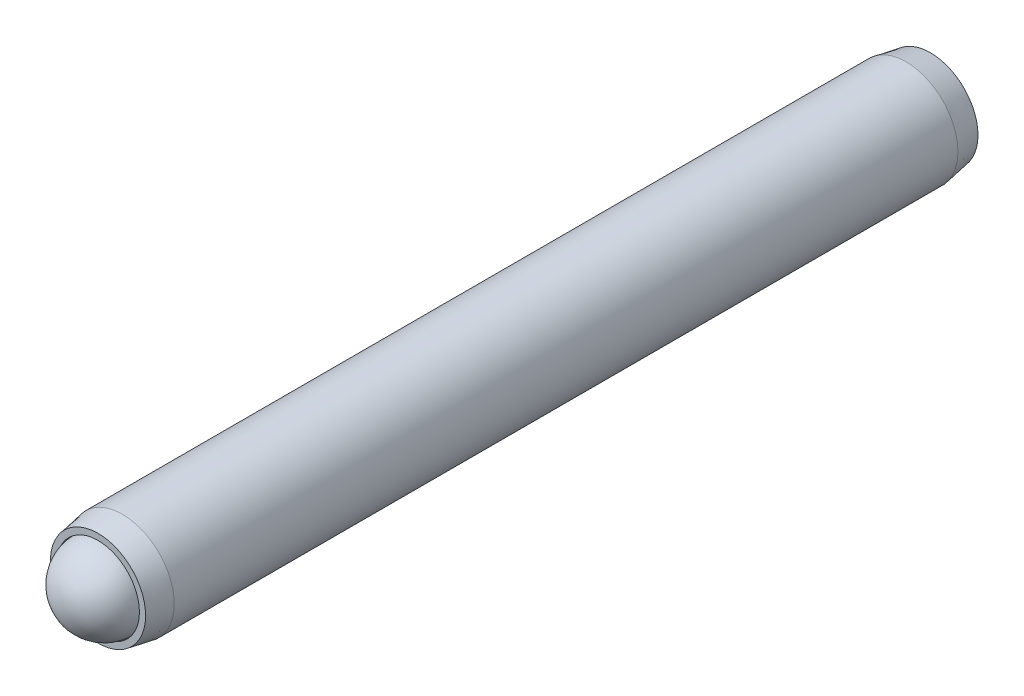
ISO-10303-21;
HEADER;
FILE_DESCRIPTION(('STEP AP214'),'2;1');
FILE_NAME('part.step','',(''),(''),'','','');
FILE_SCHEMA(('AUTOMOTIVE_DESIGN { 1 0 10303 214 1 1 1 1 }'));
ENDSEC;
DATA;
#1=APPLICATION_CONTEXT('core data for automotive mechanical design processes');
#2=APPLICATION_PROTOCOL_DEFINITION('international standard','automotive_design',2000,#1);
#3=PRODUCT_CONTEXT('',#1,'mechanical');
#4=PRODUCT('Part','Part','',(#3));
#5=PRODUCT_RELATED_PRODUCT_CATEGORY('part','',(#4));
#6=PRODUCT_DEFINITION_FORMATION('','',#4);
#7=PRODUCT_DEFINITION_CONTEXT('part definition',#1,'design');
#8=PRODUCT_DEFINITION('design','',#6,#7);
#9=PRODUCT_DEFINITION_SHAPE('','',#8);
#10=(LENGTH_UNIT() NAMED_UNIT(*) SI_UNIT(.MILLI.,.METRE.));
#11=(NAMED_UNIT(*) PLANE_ANGLE_UNIT() SI_UNIT($,.RADIAN.));
#12=(NAMED_UNIT(*) SI_UNIT($,.STERADIAN.) SOLID_ANGLE_UNIT());
#13=UNCERTAINTY_MEASURE_WITH_UNIT(LENGTH_MEASURE(1.E-05),#10,'distance_accuracy_value','');
#14=(GEOMETRIC_REPRESENTATION_CONTEXT(3) GLOBAL_UNCERTAINTY_ASSIGNED_CONTEXT((#13)) GLOBAL_UNIT_ASSIGNED_CONTEXT((#10,
#11,#12)) REPRESENTATION_CONTEXT('',''));
#15=CARTESIAN_POINT('',(0.,0.,0.));
#16=DIRECTION('',(0.,0.,1.));
#17=DIRECTION('',(1.,0.,0.));
#18=AXIS2_PLACEMENT_3D('',#15,#16,#17);
#19=CARTESIAN_POINT('',(0.,0.,24.000000038));
#20=DIRECTION('',(0.,0.,-1.));
#21=DIRECTION('',(-1.,0.,0.));
#22=AXIS2_PLACEMENT_3D('',#19,#20,#21);
#23=CYLINDRICAL_SURFACE('',#22,2.991);
#24=CARTESIAN_POINT('',(0.,0.,22.5946564030987));
#25=DIRECTION('',(0.,0.,1.));
#26=DIRECTION('',(1.,0.,0.));
#27=AXIS2_PLACEMENT_3D('',#24,#25,#26);
#28=CIRCLE('',#27,2.991);
#29=CARTESIAN_POINT('',(2.991,0.,22.5946564030987));
#30=VERTEX_POINT('',#29);
#31=EDGE_CURVE('P0_E184',#30,#30,#28,.T.);
#32=ORIENTED_EDGE('',*,*,#31,.F.);
#33=EDGE_LOOP('',(#32));
#34=FACE_BOUND('',#33,.T.);
#35=CARTESIAN_POINT('',(0.,0.,-22.5946564030986));
#36=DIRECTION('',(0.,0.,1.));
#37=DIRECTION('',(1.,0.,0.));
#38=AXIS2_PLACEMENT_3D('',#35,#36,#37);
#39=CIRCLE('',#38,2.99100000000001);
#40=CARTESIAN_POINT('',(2.99100000000001,0.,-22.5946564030986));
#41=VERTEX_POINT('',#40);
#42=EDGE_CURVE('P0_E187',#41,#41,#39,.T.);
#43=ORIENTED_EDGE('',*,*,#42,.T.);
#44=EDGE_LOOP('',(#43));
#45=FACE_BOUND('',#44,.T.);
#46=ADVANCED_FACE('P0_F16',(#34,#45),#23,.T.);
#47=CARTESIAN_POINT('',(0.,0.,24.000000038));
#48=DIRECTION('',(0.,0.,-1.));
#49=DIRECTION('',(-1.,0.,0.));
#50=AXIS2_PLACEMENT_3D('',#47,#48,#49);
#51=CONICAL_SURFACE('',#50,2.7432,0.174532925199426);
#52=ORIENTED_EDGE('',*,*,#31,.T.);
#53=EDGE_LOOP('',(#52));
#54=FACE_BOUND('',#53,.T.);
#55=CARTESIAN_POINT('',(0.,0.,24.000000038));
#56=DIRECTION('',(0.,0.,1.));
#57=DIRECTION('',(1.,0.,0.));
#58=AXIS2_PLACEMENT_3D('',#55,#56,#57);
#59=CIRCLE('',#58,2.7432);
#60=CARTESIAN_POINT('',(2.7432,0.,24.000000038));
#61=VERTEX_POINT('',#60);
#62=EDGE_CURVE('P0_E200',#61,#61,#59,.T.);
#63=ORIENTED_EDGE('',*,*,#62,.F.);
#64=EDGE_LOOP('',(#63));
#65=FACE_BOUND('',#64,.T.);
#66=ADVANCED_FACE('P0_F162',(#54,#65),#51,.T.);
#67=CARTESIAN_POINT('',(0.,0.,24.000000038));
#68=DIRECTION('',(0.,0.,1.));
#69=DIRECTION('',(1.,0.,0.));
#70=AXIS2_PLACEMENT_3D('',#67,#68,#69);
#71=PLANE('',#70);
#72=CARTESIAN_POINT('',(0.,0.,24.000000038));
#73=DIRECTION('',(0.,0.,1.));
#74=DIRECTION('',(1.,0.,0.));
#75=AXIS2_PLACEMENT_3D('',#72,#73,#74);
#76=CIRCLE('',#75,2.3876);
#77=CARTESIAN_POINT('',(2.3876,0.,24.000000038));
#78=VERTEX_POINT('',#77);
#79=EDGE_CURVE('P0_E195',#78,#78,#76,.T.);
#80=ORIENTED_EDGE('',*,*,#79,.F.);
#81=EDGE_LOOP('',(#80));
#82=FACE_BOUND('',#81,.T.);
#83=ORIENTED_EDGE('',*,*,#62,.T.);
#84=EDGE_LOOP('',(#83));
#85=FACE_BOUND('',#84,.T.);
#86=ADVANCED_FACE('P0_F159',(#82,#85),#71,.T.);
#87=CARTESIAN_POINT('',(0.,0.,-22.5946564030986));
#88=DIRECTION('',(0.,0.,1.));
#89=DIRECTION('',(1.,0.,0.));
#90=AXIS2_PLACEMENT_3D('',#87,#88,#89);
#91=CONICAL_SURFACE('',#90,2.99100000000001,0.174532925199426);
#92=CARTESIAN_POINT('',(0.,0.,-24.000000038));
#93=DIRECTION('',(0.,0.,1.));
#94=DIRECTION('',(1.,0.,0.));
#95=AXIS2_PLACEMENT_3D('',#92,#93,#94);
#96=CIRCLE('',#95,2.7432);
#97=CARTESIAN_POINT('',(2.7432,0.,-24.000000038));
#98=VERTEX_POINT('',#97);
#99=EDGE_CURVE('P0_E189',#98,#98,#96,.T.);
#100=ORIENTED_EDGE('',*,*,#99,.T.);
#101=EDGE_LOOP('',(#100));
#102=FACE_BOUND('',#101,.T.);
#103=ORIENTED_EDGE('',*,*,#42,.F.);
#104=EDGE_LOOP('',(#103));
#105=FACE_BOUND('',#104,.T.);
#106=ADVANCED_FACE('P0_F161',(#102,#105),#91,.T.);
#107=CARTESIAN_POINT('',(0.,0.,-24.000000038));
#108=DIRECTION('',(0.,0.,1.));
#109=DIRECTION('',(1.,0.,0.));
#110=AXIS2_PLACEMENT_3D('',#107,#108,#109);
#111=PLANE('',#110);
#112=CARTESIAN_POINT('',(0.,0.,-24.000000038));
#113=DIRECTION('',(0.,0.,1.));
#114=DIRECTION('',(1.,0.,0.));
#115=AXIS2_PLACEMENT_3D('',#112,#113,#114);
#116=CIRCLE('',#115,1.14567944042316);
#117=CARTESIAN_POINT('',(0.572839720211583,-0.992187499999999,-24.000000038));
#118=VERTEX_POINT('',#117);
#119=CARTESIAN_POINT('',(1.14567944042316,0.,-24.000000038));
#120=VERTEX_POINT('',#119);
#121=EDGE_CURVE('P0_E19',#118,#120,#116,.T.);
#122=ORIENTED_EDGE('',*,*,#121,.T.);
#123=CARTESIAN_POINT('',(0.572839720211582,0.9921875,-24.000000038));
#124=VERTEX_POINT('',#123);
#125=EDGE_CURVE('P0_E11',#120,#124,#116,.T.);
#126=ORIENTED_EDGE('',*,*,#125,.T.);
#127=CARTESIAN_POINT('',(-0.572839720211582,0.9921875,-24.000000038));
#128=VERTEX_POINT('',#127);
#129=EDGE_CURVE('P0_E24',#124,#128,#116,.T.);
#130=ORIENTED_EDGE('',*,*,#129,.T.);
#131=CARTESIAN_POINT('',(0.,0.,-24.000000038));
#132=DIRECTION('',(0.,0.,-1.));
#133=DIRECTION('',(-1.,0.,0.));
#134=AXIS2_PLACEMENT_3D('',#131,#132,#133);
#135=CIRCLE('',#134,1.14567944042316);
#136=CARTESIAN_POINT('',(-1.14567944042316,0.,-24.000000038));
#137=VERTEX_POINT('',#136);
#138=EDGE_CURVE('P0_E77',#137,#128,#135,.T.);
#139=ORIENTED_EDGE('',*,*,#138,.F.);
#140=CARTESIAN_POINT('',(-0.572839720211581,-0.9921875,-24.000000038));
#141=VERTEX_POINT('',#140);
#142=EDGE_CURVE('P0_E85',#137,#141,#116,.T.);
#143=ORIENTED_EDGE('',*,*,#142,.T.);
#144=EDGE_CURVE('P0_E90',#141,#118,#116,.T.);
#145=ORIENTED_EDGE('',*,*,#144,.T.);
#146=EDGE_LOOP('',(#122,#126,#130,#139,#143,#145));
#147=FACE_BOUND('',#146,.T.);
#148=ORIENTED_EDGE('',*,*,#99,.F.);
#149=EDGE_LOOP('',(#148));
#150=FACE_BOUND('',#149,.T.);
#151=ADVANCED_FACE('P0_F91',(#147,#150),#111,.F.);
#152=CARTESIAN_POINT('',(0.,0.,22.6644039925991));
#153=DIRECTION('',(0.,0.,1.));
#154=DIRECTION('',(1.,0.,0.));
#155=AXIS2_PLACEMENT_3D('',#152,#153,#154);
#156=CONICAL_SURFACE('',#155,2.3876,0.78539816339745);
#157=CARTESIAN_POINT('',(0.,0.,20.2768039925991));
#158=VERTEX_POINT('',#157);
#159=VERTEX_LOOP('',#158);
#160=FACE_BOUND('',#159,.T.);
#161=CARTESIAN_POINT('',(0.,0.,22.6644039925991));
#162=DIRECTION('',(0.,0.,1.));
#163=DIRECTION('',(1.,0.,0.));
#164=AXIS2_PLACEMENT_3D('',#161,#162,#163);
#165=CIRCLE('',#164,2.3876);
#166=CARTESIAN_POINT('',(2.3876,0.,22.6644039925991));
#167=VERTEX_POINT('',#166);
#168=EDGE_CURVE('P0_E190',#167,#167,#165,.T.);
#169=ORIENTED_EDGE('',*,*,#168,.T.);
#170=EDGE_LOOP('',(#169));
#171=FACE_BOUND('',#170,.T.);
#172=ADVANCED_FACE('P0_F165',(#160,#171),#156,.F.);
#173=CARTESIAN_POINT('',(0.,0.,24.000000038));
#174=DIRECTION('',(0.,0.,1.));
#175=DIRECTION('',(1.,0.,0.));
#176=AXIS2_PLACEMENT_3D('',#173,#174,#175);
#177=CYLINDRICAL_SURFACE('',#176,2.3876);
#178=ORIENTED_EDGE('',*,*,#168,.F.);
#179=EDGE_LOOP('',(#178));
#180=FACE_BOUND('',#179,.T.);
#181=ORIENTED_EDGE('',*,*,#79,.T.);
#182=EDGE_LOOP('',(#181));
#183=FACE_BOUND('',#182,.T.);
#184=ADVANCED_FACE('P0_F132',(#180,#183),#177,.F.);
#185=CARTESIAN_POINT('',(0.,0.,-24.000000038));
#186=DIRECTION('',(0.,0.,-1.));
#187=DIRECTION('',(-1.,0.,0.));
#188=AXIS2_PLACEMENT_3D('',#185,#186,#187);
#189=CONICAL_SURFACE('',#188,1.14567944042316,0.78539816339745);
#190=ORIENTED_EDGE('',*,*,#121,.F.);
#191=CARTESIAN_POINT('',(1.145794910477,0.000200000000000163,-24.000115525509));
#192=CARTESIAN_POINT('',(1.12609913995856,-0.0339140752321556,-23.9804328494047));
#193=CARTESIAN_POINT('',(1.10607402631377,-0.068598589492279,-23.9619057225184));
#194=CARTESIAN_POINT('',(1.06524035596264,-0.139324581199959,-23.9279823676504));
#195=CARTESIAN_POINT('',(1.04442791197037,-0.175372791624242,-23.9126050252309));
#196=CARTESIAN_POINT('',(1.00246048249572,-0.248062511737396,-23.8862631807343));
#197=CARTESIAN_POINT('',(0.981316196707011,-0.284685489013202,-23.8752324345131));
#198=CARTESIAN_POINT('',(0.938562244623587,-0.358737506246057,-23.8582362436729));
#199=CARTESIAN_POINT('',(0.916953885244212,-0.396164282559343,-23.8522581055789));
#200=CARTESIAN_POINT('',(0.879714587318153,-0.460664638605471,-23.8468663829143));
#201=CARTESIAN_POINT('',(0.864132099442441,-0.48765429931453,-23.8460690343883));
#202=CARTESIAN_POINT('',(0.832997298779852,-0.541581355945664,-23.8474082313614));
#203=CARTESIAN_POINT('',(0.817444993408172,-0.56851873902424,-23.849545424137));
#204=CARTESIAN_POINT('',(0.771010163908484,-0.648946222958497,-23.860217609306));
#205=CARTESIAN_POINT('',(0.740358726795445,-0.702036069363283,-23.8730144187227));
#206=CARTESIAN_POINT('',(0.686562055130079,-0.795214637965797,-23.9038975056501));
#207=CARTESIAN_POINT('',(0.663164549602744,-0.835740306309517,-23.9203650469077));
#208=CARTESIAN_POINT('',(0.617285982385522,-0.915204315708207,-23.9574604215568));
#209=CARTESIAN_POINT('',(0.594802217831307,-0.954147338261524,-23.9780747186455));
#210=CARTESIAN_POINT('',(0.572724250157744,-0.992387499999999,-24.000115525509));
#211=B_SPLINE_CURVE_WITH_KNOTS('',3,(#191,#192,#193,#194,#195,#196,#197,#198,#199,#200,#201,
#202,#203,#204,#205,#206,#207,#208,#209,#210),.UNSPECIFIED.,.F.,.F.,(4,2,2,2,2,2,2,2,2,4),(0.,
0.132197185210189,0.265165186853264,0.396020097605671,0.526545281028576,0.619935205043266,
0.713345731536166,0.90022005184637,1.04884529769095,1.1969930355767),.UNSPECIFIED.);
#212=EDGE_CURVE('P0_E109',#120,#118,#211,.T.);
#213=ORIENTED_EDGE('',*,*,#212,.F.);
#214=EDGE_LOOP('',(#190,#213));
#215=FACE_BOUND('',#214,.T.);
#216=ADVANCED_FACE('P0_F127',(#215),#189,.F.);
#217=ORIENTED_EDGE('',*,*,#144,.F.);
#218=CARTESIAN_POINT('',(-1.14247621095534,-0.9921875,-24.3674920775338));
#219=CARTESIAN_POINT('',(-1.11465764817298,-0.9921875,-24.3464916773704));
#220=CARTESIAN_POINT('',(-1.0866840810974,-0.9921875,-24.3256971858216));
#221=CARTESIAN_POINT('',(-1.03036405380653,-0.9921875,-24.2846050757931));
#222=CARTESIAN_POINT('',(-1.00201750238008,-0.9921875,-24.2643075824585));
#223=CARTESIAN_POINT('',(-0.915909012474787,-0.9921875,-24.2039985455809));
#224=CARTESIAN_POINT('',(-0.857501195957521,-0.9921875,-24.16489389025));
#225=CARTESIAN_POINT('',(-0.735022281337407,-0.9921875,-24.0881267908187));
#226=CARTESIAN_POINT('',(-0.670818221979874,-0.9921875,-24.0506740690437));
#227=CARTESIAN_POINT('',(-0.539203244273797,-0.9921875,-23.9821650584898));
#228=CARTESIAN_POINT('',(-0.471804119013398,-0.9921875,-23.9510872062744));
#229=CARTESIAN_POINT('',(-0.370637445291611,-0.9921875,-23.91306633425));
#230=CARTESIAN_POINT('',(-0.338367677294403,-0.9921875,-23.9021540703464));
#231=CARTESIAN_POINT('',(-0.273049086298103,-0.9921875,-23.882920268113));
#232=CARTESIAN_POINT('',(-0.24000020979791,-0.9921875,-23.8745989082603));
#233=CARTESIAN_POINT('',(-0.173878395879218,-0.9921875,-23.8611188116932));
#234=CARTESIAN_POINT('',(-0.140816774783573,-0.9921875,-23.8559054319747));
#235=CARTESIAN_POINT('',(-0.0743291672741449,-0.9921875,-23.8487397504628));
#236=CARTESIAN_POINT('',(-0.0409031260707369,-0.9921875,-23.8467879460388));
#237=CARTESIAN_POINT('',(0.0247631140270456,-0.9921875,-23.8462935239037));
#238=CARTESIAN_POINT('',(0.0570024444112259,-0.9921875,-23.8476300694157));
#239=CARTESIAN_POINT('',(0.121194220405733,-0.9921875,-23.8533710812024));
#240=CARTESIAN_POINT('',(0.15314673026799,-0.9921875,-23.8577748420789));
#241=CARTESIAN_POINT('',(0.21709052455367,-0.9921875,-23.8694845491375));
#242=CARTESIAN_POINT('',(0.249072542042749,-0.9921875,-23.8768403404107));
#243=CARTESIAN_POINT('',(0.312337779646056,-0.9921875,-23.8940631293517));
#244=CARTESIAN_POINT('',(0.34362105799319,-0.9921875,-23.9039299168974));
#245=CARTESIAN_POINT('',(0.442112982998623,-0.9921875,-23.9387061495409));
#246=CARTESIAN_POINT('',(0.507919771037746,-0.9921875,-23.967576202078));
#247=CARTESIAN_POINT('',(0.636441890981752,-0.9921875,-24.0317652478148));
#248=CARTESIAN_POINT('',(0.699145053739847,-0.9921875,-24.0671074100824));
#249=CARTESIAN_POINT('',(0.818979829838888,-0.9921875,-24.1400214087045));
#250=CARTESIAN_POINT('',(0.876233471440133,-0.9921875,-24.1773951728683));
#251=CARTESIAN_POINT('',(0.960585190489406,-0.9921875,-24.235171149699));
#252=CARTESIAN_POINT('',(0.988338378120956,-0.9921875,-24.254633525457));
#253=CARTESIAN_POINT('',(1.0434655130954,-0.9921875,-24.294073019541));
#254=CARTESIAN_POINT('',(1.070839562073,-0.9921875,-24.3140499956456));
#255=CARTESIAN_POINT('',(1.09805574489948,-0.9921875,-24.3342403433952));
#256=B_SPLINE_CURVE_WITH_KNOTS('',3,(#218,#219,#220,#221,#222,#223,#224,#225,#226,#227,#228,
#229,#230,#231,#232,#233,#234,#235,#236,#237,#238,#239,#240,#241,#242,#243,#244,#245,#246,#247,
#248,#249,#250,#251,#252,#253,#254,#255),.UNSPECIFIED.,.F.,.F.,(4,2,2,2,2,2,2,2,2,2,2,2,2,2,2,2,
2,2,4),(0.,0.104563127391605,0.209152318718919,0.419927099055486,0.642732653996016,
0.864771652302191,0.966879847198762,1.06899507437088,1.1692575299655,1.2695352735478,
1.36618351698525,1.46280954060141,1.56114078104352,1.65946379575192,1.87441437169281,
2.09015003601501,2.29516517561957,2.39685303361286,2.49851308319261),.UNSPECIFIED.);
#257=EDGE_CURVE('P0_E107',#118,#141,#256,.F.);
#258=ORIENTED_EDGE('',*,*,#257,.F.);
#259=EDGE_LOOP('',(#217,#258));
#260=FACE_BOUND('',#259,.T.);
#261=ADVANCED_FACE('P0_F131',(#260),#189,.F.);
#262=ORIENTED_EDGE('',*,*,#142,.F.);
#263=CARTESIAN_POINT('',(-0.572724250157744,-0.9923875,-24.000115525509));
#264=CARTESIAN_POINT('',(-0.592420020676185,-0.958273424767843,-23.9804328494047));
#265=CARTESIAN_POINT('',(-0.612445134320979,-0.923588910507719,-23.9619057225184));
#266=CARTESIAN_POINT('',(-0.653278804672111,-0.85286291880004,-23.9279823676504));
#267=CARTESIAN_POINT('',(-0.674091248664375,-0.816814708375757,-23.9126050252309));
#268=CARTESIAN_POINT('',(-0.716058678139022,-0.744124988262603,-23.8862631807343));
#269=CARTESIAN_POINT('',(-0.737202963927734,-0.707502010986797,-23.8752324345131));
#270=CARTESIAN_POINT('',(-0.779956916011158,-0.633449993753942,-23.8582362436729));
#271=CARTESIAN_POINT('',(-0.801565275390534,-0.596023217440656,-23.8522581055789));
#272=CARTESIAN_POINT('',(-0.838804573316593,-0.531522861394528,-23.8468663829143));
#273=CARTESIAN_POINT('',(-0.854387061192304,-0.504533200685469,-23.8460690343883));
#274=CARTESIAN_POINT('',(-0.885521861854894,-0.450606144054335,-23.8474082313614));
#275=CARTESIAN_POINT('',(-0.901074167226574,-0.423668760975759,-23.849545424137));
#276=CARTESIAN_POINT('',(-0.947508996726262,-0.343241277041502,-23.860217609306));
#277=CARTESIAN_POINT('',(-0.9781604338393,-0.290151430636716,-23.8730144187227));
#278=CARTESIAN_POINT('',(-1.03195710550467,-0.196972862034201,-23.9038975056501));
#279=CARTESIAN_POINT('',(-1.055354611032,-0.156447193690482,-23.9203650469077));
#280=CARTESIAN_POINT('',(-1.10123317824922,-0.0769831842917917,-23.9574604215568));
#281=CARTESIAN_POINT('',(-1.12371694280344,-0.0380401617384757,-23.9780747186455));
#282=CARTESIAN_POINT('',(-1.145794910477,0.000200000000000038,-24.000115525509));
#283=B_SPLINE_CURVE_WITH_KNOTS('',3,(#263,#264,#265,#266,#267,#268,#269,#270,#271,#272,#273,
#274,#275,#276,#277,#278,#279,#280,#281,#282),.UNSPECIFIED.,.F.,.F.,(4,2,2,2,2,2,2,2,2,4),(0.,
0.132197185210191,0.265165186853264,0.396020097605672,0.526545281028576,0.619935205043266,
0.713345731536166,0.900220051846371,1.04884529769095,1.1969930355767),.UNSPECIFIED.);
#284=EDGE_CURVE('P0_E80',#141,#137,#283,.T.);
#285=ORIENTED_EDGE('',*,*,#284,.F.);
#286=EDGE_LOOP('',(#262,#285));
#287=FACE_BOUND('',#286,.T.);
#288=ADVANCED_FACE('P0_F86',(#287),#189,.F.);
#289=ORIENTED_EDGE('',*,*,#138,.T.);
#290=CARTESIAN_POINT('',(-1.145794910477,-0.000200000000000018,-24.000115525509));
#291=CARTESIAN_POINT('',(-1.12609913995856,0.0339140752321562,-23.9804328494047));
#292=CARTESIAN_POINT('',(-1.10607402631377,0.06859858949228,-23.9619057225184));
#293=CARTESIAN_POINT('',(-1.06524035596264,0.139324581199959,-23.9279823676504));
#294=CARTESIAN_POINT('',(-1.04442791197037,0.175372791624242,-23.9126050252309));
#295=CARTESIAN_POINT('',(-1.00246048249572,0.248062511737396,-23.8862631807343));
#296=CARTESIAN_POINT('',(-0.981316196707011,0.284685489013201,-23.8752324345131));
#297=CARTESIAN_POINT('',(-0.938562244623587,0.358737506246057,-23.8582362436729));
#298=CARTESIAN_POINT('',(-0.916953885244212,0.396164282559343,-23.8522581055789));
#299=CARTESIAN_POINT('',(-0.879714587318153,0.460664638605472,-23.8468663829143));
#300=CARTESIAN_POINT('',(-0.864132099442441,0.48765429931453,-23.8460690343883));
#301=CARTESIAN_POINT('',(-0.832997298779851,0.541581355945665,-23.8474082313614));
#302=CARTESIAN_POINT('',(-0.817444993408172,0.568518739024241,-23.849545424137));
#303=CARTESIAN_POINT('',(-0.771010163908484,0.648946222958498,-23.860217609306));
#304=CARTESIAN_POINT('',(-0.740358726795445,0.702036069363284,-23.8730144187227));
#305=CARTESIAN_POINT('',(-0.686562055130079,0.795214637965798,-23.9038975056501));
#306=CARTESIAN_POINT('',(-0.663164549602744,0.835740306309517,-23.9203650469077));
#307=CARTESIAN_POINT('',(-0.617285982385523,0.915204315708208,-23.9574604215568));
#308=CARTESIAN_POINT('',(-0.594802217831308,0.954147338261524,-23.9780747186455));
#309=CARTESIAN_POINT('',(-0.572724250157744,0.992387499999999,-24.000115525509));
#310=B_SPLINE_CURVE_WITH_KNOTS('',3,(#290,#291,#292,#293,#294,#295,#296,#297,#298,#299,#300,
#301,#302,#303,#304,#305,#306,#307,#308,#309),.UNSPECIFIED.,.F.,.F.,(4,2,2,2,2,2,2,2,2,4),(0.,
0.13219718521019,0.265165186853263,0.396020097605671,0.526545281028575,0.619935205043266,
0.713345731536166,0.90022005184637,1.04884529769095,1.1969930355767),.UNSPECIFIED.);
#311=EDGE_CURVE('P0_E73',#137,#128,#310,.T.);
#312=ORIENTED_EDGE('',*,*,#311,.F.);
#313=EDGE_LOOP('',(#289,#312));
#314=FACE_BOUND('',#313,.T.);
#315=ADVANCED_FACE('P0_F75',(#314),#189,.F.);
#316=ORIENTED_EDGE('',*,*,#129,.F.);
#317=CARTESIAN_POINT('',(-1.14247621078911,0.9921875,-24.3674920774083));
#318=CARTESIAN_POINT('',(-1.11465764801141,0.9921875,-24.3464916772497));
#319=CARTESIAN_POINT('',(-1.08668408094051,0.9921875,-24.3256971857058));
#320=CARTESIAN_POINT('',(-1.03036405365905,0.9921875,-24.2846050756869));
#321=CARTESIAN_POINT('',(-1.00201750223733,0.9921875,-24.2643075823571));
#322=CARTESIAN_POINT('',(-0.915909012346498,0.9921875,-24.2039985454939));
#323=CARTESIAN_POINT('',(-0.857501195839068,0.9921875,-24.1648938901726));
#324=CARTESIAN_POINT('',(-0.735022281240406,0.9921875,-24.0881267907611));
#325=CARTESIAN_POINT('',(-0.670818221894546,0.9921875,-24.0506740689963));
#326=CARTESIAN_POINT('',(-0.539203244212806,0.9921875,-23.982165058461));
#327=CARTESIAN_POINT('',(-0.471804118965064,0.9921875,-23.9510872062543));
#328=CARTESIAN_POINT('',(-0.370637445252799,0.9921875,-23.9130663342363));
#329=CARTESIAN_POINT('',(-0.338367677251605,0.9921875,-23.9021540703325));
#330=CARTESIAN_POINT('',(-0.273049086247197,0.9921875,-23.8829202680993));
#331=CARTESIAN_POINT('',(-0.240000209742887,0.9921875,-23.8745989082472));
#332=CARTESIAN_POINT('',(-0.173878395816094,0.9921875,-23.8611188116822));
#333=CARTESIAN_POINT('',(-0.14081677471647,0.9921875,-23.8559054319651));
#334=CARTESIAN_POINT('',(-0.074329167199213,0.9921875,-23.8487397504571));
#335=CARTESIAN_POINT('',(-0.0409031259919557,0.9921875,-23.8467879460354));
#336=CARTESIAN_POINT('',(0.0247631141129277,0.9921875,-23.8462935239057));
#337=CARTESIAN_POINT('',(0.0570024445003693,0.9921875,-23.8476300694208));
#338=CARTESIAN_POINT('',(0.121194220501073,0.9921875,-23.8533710812138));
#339=CARTESIAN_POINT('',(0.153146730366265,0.9921875,-23.8577748420939));
#340=CARTESIAN_POINT('',(0.217090524657739,0.9921875,-23.8694845491597));
#341=CARTESIAN_POINT('',(0.249072542149667,0.9921875,-23.8768403404366));
#342=CARTESIAN_POINT('',(0.312337779758398,0.9921875,-23.8940631293854));
#343=CARTESIAN_POINT('',(0.343621058108108,0.9921875,-23.903929916935));
#344=CARTESIAN_POINT('',(0.442112983138565,0.9921875,-23.9387061495969));
#345=CARTESIAN_POINT('',(0.507919771198882,0.9921875,-23.9675762021508));
#346=CARTESIAN_POINT('',(0.636441891183648,0.9921875,-24.0317652479233));
#347=CARTESIAN_POINT('',(0.699145053961298,0.9921875,-24.0671074102097));
#348=CARTESIAN_POINT('',(0.818979830095498,0.9921875,-24.1400214088677));
#349=CARTESIAN_POINT('',(0.876233471712472,0.9921875,-24.1773951730485));
#350=CARTESIAN_POINT('',(0.960585190785002,0.9921875,-24.2351711499045));
#351=CARTESIAN_POINT('',(0.988338378424193,0.9921875,-24.254633525671));
#352=CARTESIAN_POINT('',(1.04346551341387,0.9921875,-24.2940730197717));
#353=CARTESIAN_POINT('',(1.07083956239906,0.9921875,-24.3140499958848));
#354=CARTESIAN_POINT('',(1.09805574523312,0.9921875,-24.3342403436427));
#355=B_SPLINE_CURVE_WITH_KNOTS('',3,(#317,#318,#319,#320,#321,#322,#323,#324,#325,#326,#327,
#328,#329,#330,#331,#332,#333,#334,#335,#336,#337,#338,#339,#340,#341,#342,#343,#344,#345,#346,
#347,#348,#349,#350,#351,#352,#353,#354),.UNSPECIFIED.,.F.,.F.,(4,2,2,2,2,2,2,2,2,2,2,2,2,2,2,2,
2,2,4),(0.,0.104563127371705,0.209152318679109,0.419927098975114,0.642732653870155,
0.864771652131277,0.96687984703938,1.06899507422301,1.16925752982867,1.26953527342202,
1.36618351686958,1.46280954049585,1.56114078094885,1.65946379566814,1.87441437168728,
2.09015003608823,2.29516517576017,2.3968530337867,2.49851308339969),.UNSPECIFIED.);
#356=EDGE_CURVE('P0_E81',#128,#124,#355,.T.);
#357=ORIENTED_EDGE('',*,*,#356,.F.);
#358=EDGE_LOOP('',(#316,#357));
#359=FACE_BOUND('',#358,.T.);
#360=ADVANCED_FACE('P0_F231',(#359),#189,.F.);
#361=ORIENTED_EDGE('',*,*,#125,.F.);
#362=CARTESIAN_POINT('',(0.572724250157744,0.9923875,-24.000115525509));
#363=CARTESIAN_POINT('',(0.592420020676185,0.958273424767844,-23.9804328494047));
#364=CARTESIAN_POINT('',(0.612445134320979,0.92358891050772,-23.9619057225184));
#365=CARTESIAN_POINT('',(0.653278804672111,0.85286291880004,-23.9279823676504));
#366=CARTESIAN_POINT('',(0.674091248664375,0.816814708375757,-23.9126050252309));
#367=CARTESIAN_POINT('',(0.716058678139022,0.744124988262603,-23.8862631807343));
#368=CARTESIAN_POINT('',(0.737202963927734,0.707502010986798,-23.8752324345131));
#369=CARTESIAN_POINT('',(0.779956916011158,0.633449993753943,-23.8582362436729));
#370=CARTESIAN_POINT('',(0.801565275390534,0.596023217440656,-23.8522581055789));
#371=CARTESIAN_POINT('',(0.838804573316593,0.531522861394528,-23.8468663829143));
#372=CARTESIAN_POINT('',(0.854387061192304,0.504533200685469,-23.8460690343883));
#373=CARTESIAN_POINT('',(0.885521861854894,0.450606144054335,-23.8474082313614));
#374=CARTESIAN_POINT('',(0.901074167226574,0.423668760975759,-23.849545424137));
#375=CARTESIAN_POINT('',(0.947508996726262,0.343241277041501,-23.860217609306));
#376=CARTESIAN_POINT('',(0.978160433839301,0.290151430636716,-23.8730144187227));
#377=CARTESIAN_POINT('',(1.03195710550467,0.196972862034202,-23.9038975056501));
#378=CARTESIAN_POINT('',(1.055354611032,0.156447193690483,-23.9203650469077));
#379=CARTESIAN_POINT('',(1.10123317824922,0.0769831842917921,-23.9574604215568));
#380=CARTESIAN_POINT('',(1.12371694280344,0.0380401617384761,-23.9780747186455));
#381=CARTESIAN_POINT('',(1.145794910477,-0.000199999999999809,-24.000115525509));
#382=B_SPLINE_CURVE_WITH_KNOTS('',3,(#362,#363,#364,#365,#366,#367,#368,#369,#370,#371,#372,
#373,#374,#375,#376,#377,#378,#379,#380,#381),.UNSPECIFIED.,.F.,.F.,(4,2,2,2,2,2,2,2,2,4),(0.,
0.132197185210191,0.265165186853264,0.396020097605672,0.526545281028575,0.619935205043266,
0.713345731536166,0.900220051846371,1.04884529769095,1.1969930355767),.UNSPECIFIED.);
#383=EDGE_CURVE('P0_E94',#124,#120,#382,.T.);
#384=ORIENTED_EDGE('',*,*,#383,.F.);
#385=EDGE_LOOP('',(#361,#384));
#386=FACE_BOUND('',#385,.T.);
#387=ADVANCED_FACE('P0_F134',(#386),#189,.F.);
#388=CARTESIAN_POINT('',(0.,0.,-20.952000038));
#389=DIRECTION('',(0.,0.,-1.));
#390=DIRECTION('',(-1.,0.,0.));
#391=AXIS2_PLACEMENT_3D('',#388,#389,#390);
#392=PLANE('',#391);
#393=DIRECTION('',(1.,0.,0.));
#394=VECTOR('',#393,1.);
#395=CARTESIAN_POINT('',(-0.572839720211582,0.9921875,-20.952000038));
#396=LINE('',#395,#394);
#397=CARTESIAN_POINT('',(-0.572839720211582,0.9921875,-20.952000038));
#398=VERTEX_POINT('',#397);
#399=CARTESIAN_POINT('',(0.572839720211582,0.9921875,-20.952000038));
#400=VERTEX_POINT('',#399);
#401=EDGE_CURVE('P0_E203',#398,#400,#396,.T.);
#402=ORIENTED_EDGE('',*,*,#401,.T.);
#403=DIRECTION('',(0.5,-0.866025403784439,0.));
#404=VECTOR('',#403,1.);
#405=CARTESIAN_POINT('',(0.572839720211582,0.9921875,-20.952000038));
#406=LINE('',#405,#404);
#407=CARTESIAN_POINT('',(1.14567944042316,0.,-20.952000038));
#408=VERTEX_POINT('',#407);
#409=EDGE_CURVE('P0_E206',#400,#408,#406,.T.);
#410=ORIENTED_EDGE('',*,*,#409,.T.);
#411=DIRECTION('',(-0.5,-0.866025403784438,0.));
#412=VECTOR('',#411,1.);
#413=CARTESIAN_POINT('',(1.14567944042316,0.,-20.952000038));
#414=LINE('',#413,#412);
#415=CARTESIAN_POINT('',(0.572839720211582,-0.9921875,-20.952000038));
#416=VERTEX_POINT('',#415);
#417=EDGE_CURVE('P0_E209',#408,#416,#414,.T.);
#418=ORIENTED_EDGE('',*,*,#417,.T.);
#419=DIRECTION('',(-1.,0.,0.));
#420=VECTOR('',#419,1.);
#421=CARTESIAN_POINT('',(0.572839720211582,-0.9921875,-20.952000038));
#422=LINE('',#421,#420);
#423=CARTESIAN_POINT('',(-0.572839720211582,-0.9921875,-20.952000038));
#424=VERTEX_POINT('',#423);
#425=EDGE_CURVE('P0_E212',#416,#424,#422,.T.);
#426=ORIENTED_EDGE('',*,*,#425,.T.);
#427=DIRECTION('',(-0.5,0.866025403784439,0.));
#428=VECTOR('',#427,1.);
#429=CARTESIAN_POINT('',(-0.572839720211582,-0.9921875,-20.952000038));
#430=LINE('',#429,#428);
#431=CARTESIAN_POINT('',(-1.14567944042316,0.,-20.952000038));
#432=VERTEX_POINT('',#431);
#433=EDGE_CURVE('P0_E215',#424,#432,#430,.T.);
#434=ORIENTED_EDGE('',*,*,#433,.T.);
#435=DIRECTION('',(0.5,0.866025403784439,0.));
#436=VECTOR('',#435,1.);
#437=CARTESIAN_POINT('',(-1.14567944042316,0.,-20.952000038));
#438=LINE('',#437,#436);
#439=EDGE_CURVE('P0_E99',#432,#398,#438,.T.);
#440=ORIENTED_EDGE('',*,*,#439,.T.);
#441=EDGE_LOOP('',(#402,#410,#418,#426,#434,#440));
#442=FACE_BOUND('',#441,.T.);
#443=ADVANCED_FACE('P0_F240',(#442),#392,.T.);
#444=CARTESIAN_POINT('',(0.572839720211582,0.9921875,-20.952000038));
#445=DIRECTION('',(0.866025403784439,0.5,0.));
#446=DIRECTION('',(-0.5,0.866025403784439,0.));
#447=AXIS2_PLACEMENT_3D('',#444,#445,#446);
#448=PLANE('',#447);
#449=DIRECTION('',(0.,0.,-1.));
#450=VECTOR('',#449,1.);
#451=CARTESIAN_POINT('',(0.572839720211582,0.9921875,-20.952000038));
#452=LINE('',#451,#450);
#453=EDGE_CURVE('P0_E218',#400,#124,#452,.T.);
#454=ORIENTED_EDGE('',*,*,#453,.T.);
#455=ORIENTED_EDGE('',*,*,#383,.T.);
#456=DIRECTION('',(0.,0.,-1.));
#457=VECTOR('',#456,1.);
#458=CARTESIAN_POINT('',(1.14567944042316,0.,-20.952000038));
#459=LINE('',#458,#457);
#460=EDGE_CURVE('P0_E224',#408,#120,#459,.T.);
#461=ORIENTED_EDGE('',*,*,#460,.F.);
#462=ORIENTED_EDGE('',*,*,#409,.F.);
#463=EDGE_LOOP('',(#454,#455,#461,#462));
#464=FACE_BOUND('',#463,.T.);
#465=ADVANCED_FACE('P0_F155',(#464),#448,.F.);
#466=CARTESIAN_POINT('',(-0.572839720211582,0.9921875,-20.952000038));
#467=DIRECTION('',(0.,1.,0.));
#468=DIRECTION('',(0.,0.,1.));
#469=AXIS2_PLACEMENT_3D('',#466,#467,#468);
#470=PLANE('',#469);
#471=DIRECTION('',(0.,0.,-1.));
#472=VECTOR('',#471,1.);
#473=CARTESIAN_POINT('',(-0.572839720211582,0.9921875,-20.952000038));
#474=LINE('',#473,#472);
#475=EDGE_CURVE('P0_E37',#398,#128,#474,.T.);
#476=ORIENTED_EDGE('',*,*,#475,.T.);
#477=ORIENTED_EDGE('',*,*,#356,.T.);
#478=ORIENTED_EDGE('',*,*,#453,.F.);
#479=ORIENTED_EDGE('',*,*,#401,.F.);
#480=EDGE_LOOP('',(#476,#477,#478,#479));
#481=FACE_BOUND('',#480,.T.);
#482=ADVANCED_FACE('P0_F151',(#481),#470,.F.);
#483=CARTESIAN_POINT('',(-1.14567944042316,0.,-20.952000038));
#484=DIRECTION('',(-0.866025403784439,0.5,0.));
#485=DIRECTION('',(-0.5,-0.866025403784439,0.));
#486=AXIS2_PLACEMENT_3D('',#483,#484,#485);
#487=PLANE('',#486);
#488=DIRECTION('',(0.,0.,-1.));
#489=VECTOR('',#488,1.);
#490=CARTESIAN_POINT('',(-1.14567944042316,0.,-20.952000038));
#491=LINE('',#490,#489);
#492=EDGE_CURVE('P0_E96',#432,#137,#491,.T.);
#493=ORIENTED_EDGE('',*,*,#492,.T.);
#494=ORIENTED_EDGE('',*,*,#311,.T.);
#495=ORIENTED_EDGE('',*,*,#475,.F.);
#496=ORIENTED_EDGE('',*,*,#439,.F.);
#497=EDGE_LOOP('',(#493,#494,#495,#496));
#498=FACE_BOUND('',#497,.T.);
#499=ADVANCED_FACE('P0_F97',(#498),#487,.F.);
#500=CARTESIAN_POINT('',(-0.572839720211582,-0.9921875,-20.952000038));
#501=DIRECTION('',(-0.866025403784439,-0.5,0.));
#502=DIRECTION('',(0.5,-0.866025403784439,0.));
#503=AXIS2_PLACEMENT_3D('',#500,#501,#502);
#504=PLANE('',#503);
#505=DIRECTION('',(0.,0.,-1.));
#506=VECTOR('',#505,1.);
#507=CARTESIAN_POINT('',(-0.572839720211582,-0.9921875,-20.952000038));
#508=LINE('',#507,#506);
#509=EDGE_CURVE('P0_E103',#424,#141,#508,.T.);
#510=ORIENTED_EDGE('',*,*,#509,.T.);
#511=ORIENTED_EDGE('',*,*,#284,.T.);
#512=ORIENTED_EDGE('',*,*,#492,.F.);
#513=ORIENTED_EDGE('',*,*,#433,.F.);
#514=EDGE_LOOP('',(#510,#511,#512,#513));
#515=FACE_BOUND('',#514,.T.);
#516=ADVANCED_FACE('P0_F105',(#515),#504,.F.);
#517=CARTESIAN_POINT('',(0.572839720211582,-0.9921875,-20.952000038));
#518=DIRECTION('',(0.,-1.,0.));
#519=DIRECTION('',(1.,0.,0.));
#520=AXIS2_PLACEMENT_3D('',#517,#518,#519);
#521=PLANE('',#520);
#522=DIRECTION('',(0.,0.,-1.));
#523=VECTOR('',#522,1.);
#524=CARTESIAN_POINT('',(0.572839720211582,-0.9921875,-20.952000038));
#525=LINE('',#524,#523);
#526=EDGE_CURVE('P0_E221',#416,#118,#525,.T.);
#527=ORIENTED_EDGE('',*,*,#526,.T.);
#528=ORIENTED_EDGE('',*,*,#257,.T.);
#529=ORIENTED_EDGE('',*,*,#509,.F.);
#530=ORIENTED_EDGE('',*,*,#425,.F.);
#531=EDGE_LOOP('',(#527,#528,#529,#530));
#532=FACE_BOUND('',#531,.T.);
#533=ADVANCED_FACE('P0_F242',(#532),#521,.F.);
#534=CARTESIAN_POINT('',(1.14567944042316,0.,-20.952000038));
#535=DIRECTION('',(0.866025403784438,-0.5,0.));
#536=DIRECTION('',(0.5,0.866025403784439,0.));
#537=AXIS2_PLACEMENT_3D('',#534,#535,#536);
#538=PLANE('',#537);
#539=ORIENTED_EDGE('',*,*,#460,.T.);
#540=ORIENTED_EDGE('',*,*,#212,.T.);
#541=ORIENTED_EDGE('',*,*,#526,.F.);
#542=ORIENTED_EDGE('',*,*,#417,.F.);
#543=EDGE_LOOP('',(#539,#540,#541,#542));
#544=FACE_BOUND('',#543,.T.);
#545=ADVANCED_FACE('P0_F237',(#544),#538,.F.);
#546=CLOSED_SHELL('',(#46,#66,#86,#106,#151,#172,#184,#216,#261,#288,#315,#360,#387,#443,#465,
#482,#499,#516,#533,#545));
#547=MANIFOLD_SOLID_BREP('P0_B1',#546);
#548=CARTESIAN_POINT('',(0.,0.,23.644400038));
#549=DIRECTION('',(0.,1.,0.));
#550=DIRECTION('',(1.,0.,0.));
#551=AXIS2_PLACEMENT_3D('',#548,#549,#550);
#552=SPHERICAL_SURFACE('',#551,2.38125);
#553=CARTESIAN_POINT('',(0.,0.,23.644400038));
#554=DIRECTION('',(0.,0.,-1.));
#555=DIRECTION('',(1.,0.,0.));
#556=AXIS2_PLACEMENT_3D('',#553,#554,#555);
#557=SPHERICAL_SURFACE('',#556,2.38125);
#558=CARTESIAN_POINT('',(0.,0.,23.644400038));
#559=DIRECTION('',(0.,0.,-1.));
#560=DIRECTION('',(1.,0.,0.));
#561=AXIS2_PLACEMENT_3D('',#558,#559,#560);
#562=CIRCLE('',#561,2.38125);
#563=CARTESIAN_POINT('',(2.38125,0.,23.644400038));
#564=VERTEX_POINT('',#563);
#565=EDGE_CURVE('P1_E9',#564,#564,#562,.T.);
#566=ORIENTED_EDGE('',*,*,#565,.T.);
#567=EDGE_LOOP('',(#566));
#568=FACE_BOUND('',#567,.T.);
#569=ADVANCED_FACE('P1_F13',(#568),#557,.T.);
#570=CARTESIAN_POINT('',(0.,0.,23.644400038));
#571=DIRECTION('',(0.,0.,-1.));
#572=DIRECTION('',(1.,0.,0.));
#573=AXIS2_PLACEMENT_3D('',#570,#571,#572);
#574=SPHERICAL_SURFACE('',#573,2.38125);
#575=ORIENTED_EDGE('',*,*,#565,.F.);
#576=EDGE_LOOP('',(#575));
#577=FACE_BOUND('',#576,.T.);
#578=ADVANCED_FACE('P1_F15',(#577),#574,.T.);
#579=CLOSED_SHELL('',(#569,#578));
#580=MANIFOLD_SOLID_BREP('P1_B1',#579);
#581=ADVANCED_BREP_SHAPE_REPRESENTATION('',(#18,#547,#580),#14);
#582=SHAPE_DEFINITION_REPRESENTATION(#9,#581);
ENDSEC;
END-ISO-10303-21;
